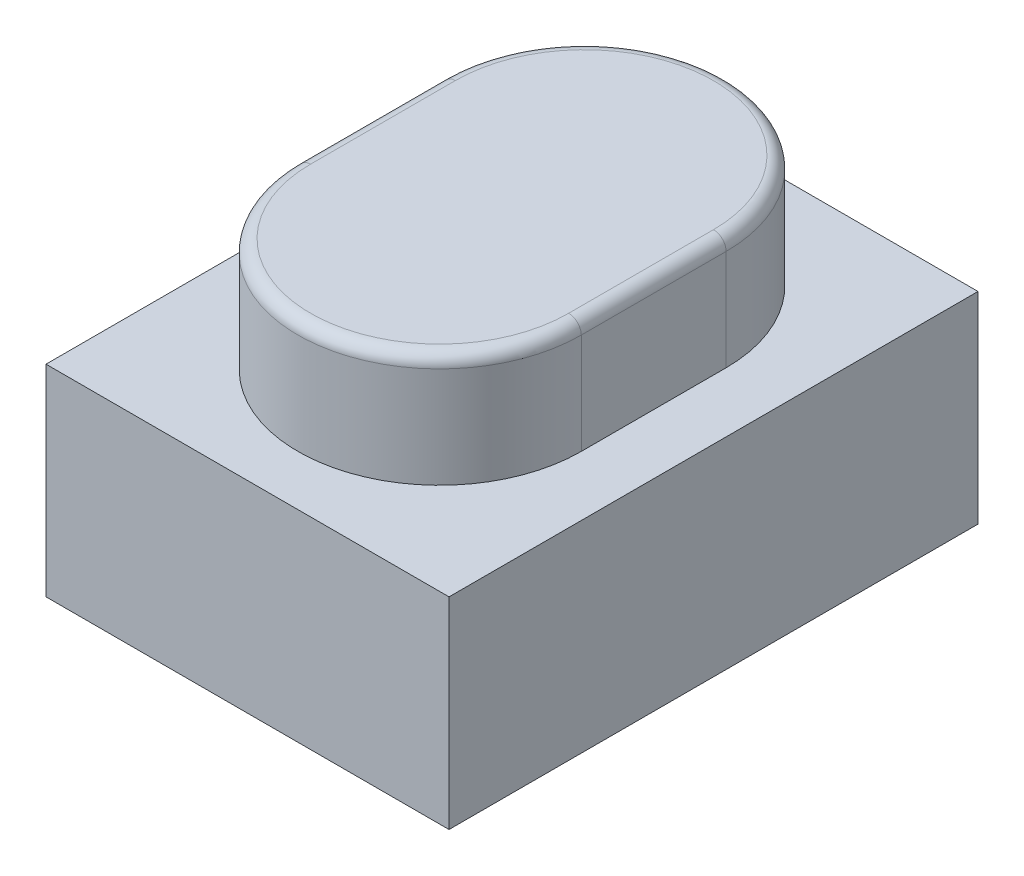
ISO-10303-21;
HEADER;
FILE_DESCRIPTION(('STEP AP214'),'2;1');
FILE_NAME('part.step','',(''),(''),'','','');
FILE_SCHEMA(('AUTOMOTIVE_DESIGN { 1 0 10303 214 1 1 1 1 }'));
ENDSEC;
DATA;
#1=APPLICATION_CONTEXT('core data for automotive mechanical design processes');
#2=APPLICATION_PROTOCOL_DEFINITION('international standard','automotive_design',2000,#1);
#3=PRODUCT_CONTEXT('',#1,'mechanical');
#4=PRODUCT('Part','Part','',(#3));
#5=PRODUCT_RELATED_PRODUCT_CATEGORY('part','',(#4));
#6=PRODUCT_DEFINITION_FORMATION('','',#4);
#7=PRODUCT_DEFINITION_CONTEXT('part definition',#1,'design');
#8=PRODUCT_DEFINITION('design','',#6,#7);
#9=PRODUCT_DEFINITION_SHAPE('','',#8);
#10=(LENGTH_UNIT() NAMED_UNIT(*) SI_UNIT(.MILLI.,.METRE.));
#11=(NAMED_UNIT(*) PLANE_ANGLE_UNIT() SI_UNIT($,.RADIAN.));
#12=(NAMED_UNIT(*) SI_UNIT($,.STERADIAN.) SOLID_ANGLE_UNIT());
#13=UNCERTAINTY_MEASURE_WITH_UNIT(LENGTH_MEASURE(1.E-05),#10,'distance_accuracy_value','');
#14=(GEOMETRIC_REPRESENTATION_CONTEXT(3) GLOBAL_UNCERTAINTY_ASSIGNED_CONTEXT((#13)) GLOBAL_UNIT_ASSIGNED_CONTEXT((#10,
#11,#12)) REPRESENTATION_CONTEXT('',''));
#15=CARTESIAN_POINT('',(0.,0.,0.));
#16=DIRECTION('',(0.,0.,1.));
#17=DIRECTION('',(1.,0.,0.));
#18=AXIS2_PLACEMENT_3D('',#15,#16,#17);
#19=CARTESIAN_POINT('',(1.6,1.6,-2.1));
#20=DIRECTION('',(-1.,0.,0.));
#21=DIRECTION('',(0.,0.,1.));
#22=AXIS2_PLACEMENT_3D('',#19,#20,#21);
#23=PLANE('',#22);
#24=DIRECTION('',(0.,0.,-1.));
#25=VECTOR('',#24,1.);
#26=CARTESIAN_POINT('',(1.6,0.,-2.1));
#27=LINE('',#26,#25);
#28=CARTESIAN_POINT('',(1.6,0.,2.1));
#29=VERTEX_POINT('',#28);
#30=CARTESIAN_POINT('',(1.6,0.,-2.1));
#31=VERTEX_POINT('',#30);
#32=EDGE_CURVE('E148',#29,#31,#27,.T.);
#33=ORIENTED_EDGE('',*,*,#32,.T.);
#34=DIRECTION('',(0.,-1.,0.));
#35=VECTOR('',#34,1.);
#36=CARTESIAN_POINT('',(1.6,1.6,-2.1));
#37=LINE('',#36,#35);
#38=CARTESIAN_POINT('',(1.6,1.6,-2.1));
#39=VERTEX_POINT('',#38);
#40=EDGE_CURVE('E175',#39,#31,#37,.T.);
#41=ORIENTED_EDGE('',*,*,#40,.F.);
#42=DIRECTION('',(0.,0.,-1.));
#43=VECTOR('',#42,1.);
#44=CARTESIAN_POINT('',(1.6,1.6,-2.1));
#45=LINE('',#44,#43);
#46=CARTESIAN_POINT('',(1.6,1.6,2.1));
#47=VERTEX_POINT('',#46);
#48=EDGE_CURVE('E149',#47,#39,#45,.T.);
#49=ORIENTED_EDGE('',*,*,#48,.F.);
#50=DIRECTION('',(0.,-1.,0.));
#51=VECTOR('',#50,1.);
#52=CARTESIAN_POINT('',(1.6,1.6,2.1));
#53=LINE('',#52,#51);
#54=EDGE_CURVE('E159',#47,#29,#53,.T.);
#55=ORIENTED_EDGE('',*,*,#54,.T.);
#56=EDGE_LOOP('',(#33,#41,#49,#55));
#57=FACE_BOUND('',#56,.T.);
#58=ADVANCED_FACE('F43',(#57),#23,.F.);
#59=CARTESIAN_POINT('',(-1.6,1.6,-2.1));
#60=DIRECTION('',(0.,0.,1.));
#61=DIRECTION('',(1.,0.,0.));
#62=AXIS2_PLACEMENT_3D('',#59,#60,#61);
#63=PLANE('',#62);
#64=DIRECTION('',(-1.,0.,0.));
#65=VECTOR('',#64,1.);
#66=CARTESIAN_POINT('',(-1.6,0.,-2.1));
#67=LINE('',#66,#65);
#68=CARTESIAN_POINT('',(-1.6,0.,-2.1));
#69=VERTEX_POINT('',#68);
#70=EDGE_CURVE('E162',#31,#69,#67,.T.);
#71=ORIENTED_EDGE('',*,*,#70,.T.);
#72=DIRECTION('',(0.,-1.,0.));
#73=VECTOR('',#72,1.);
#74=CARTESIAN_POINT('',(-1.6,1.6,-2.1));
#75=LINE('',#74,#73);
#76=CARTESIAN_POINT('',(-1.6,1.6,-2.1));
#77=VERTEX_POINT('',#76);
#78=EDGE_CURVE('E172',#77,#69,#75,.T.);
#79=ORIENTED_EDGE('',*,*,#78,.F.);
#80=DIRECTION('',(-1.,0.,0.));
#81=VECTOR('',#80,1.);
#82=CARTESIAN_POINT('',(-1.6,1.6,-2.1));
#83=LINE('',#82,#81);
#84=EDGE_CURVE('E152',#39,#77,#83,.T.);
#85=ORIENTED_EDGE('',*,*,#84,.F.);
#86=ORIENTED_EDGE('',*,*,#40,.T.);
#87=EDGE_LOOP('',(#71,#79,#85,#86));
#88=FACE_BOUND('',#87,.T.);
#89=ADVANCED_FACE('F230',(#88),#63,.F.);
#90=CARTESIAN_POINT('',(-1.6,1.6,-2.1));
#91=DIRECTION('',(1.,0.,0.));
#92=DIRECTION('',(0.,0.,-1.));
#93=AXIS2_PLACEMENT_3D('',#90,#91,#92);
#94=PLANE('',#93);
#95=DIRECTION('',(0.,0.,1.));
#96=VECTOR('',#95,1.);
#97=CARTESIAN_POINT('',(-1.6,0.,-2.1));
#98=LINE('',#97,#96);
#99=CARTESIAN_POINT('',(-1.6,0.,2.1));
#100=VERTEX_POINT('',#99);
#101=EDGE_CURVE('E164',#69,#100,#98,.T.);
#102=ORIENTED_EDGE('',*,*,#101,.T.);
#103=DIRECTION('',(0.,-1.,0.));
#104=VECTOR('',#103,1.);
#105=CARTESIAN_POINT('',(-1.6,1.6,2.1));
#106=LINE('',#105,#104);
#107=CARTESIAN_POINT('',(-1.6,1.6,2.1));
#108=VERTEX_POINT('',#107);
#109=EDGE_CURVE('E169',#108,#100,#106,.T.);
#110=ORIENTED_EDGE('',*,*,#109,.F.);
#111=DIRECTION('',(0.,0.,1.));
#112=VECTOR('',#111,1.);
#113=CARTESIAN_POINT('',(-1.6,1.6,-2.1));
#114=LINE('',#113,#112);
#115=EDGE_CURVE('E155',#77,#108,#114,.T.);
#116=ORIENTED_EDGE('',*,*,#115,.F.);
#117=ORIENTED_EDGE('',*,*,#78,.T.);
#118=EDGE_LOOP('',(#102,#110,#116,#117));
#119=FACE_BOUND('',#118,.T.);
#120=ADVANCED_FACE('F236',(#119),#94,.F.);
#121=CARTESIAN_POINT('',(-1.6,1.6,2.1));
#122=DIRECTION('',(0.,0.,-1.));
#123=DIRECTION('',(-1.,0.,0.));
#124=AXIS2_PLACEMENT_3D('',#121,#122,#123);
#125=PLANE('',#124);
#126=DIRECTION('',(1.,0.,0.));
#127=VECTOR('',#126,1.);
#128=CARTESIAN_POINT('',(-1.6,0.,2.1));
#129=LINE('',#128,#127);
#130=EDGE_CURVE('E153',#100,#29,#129,.T.);
#131=ORIENTED_EDGE('',*,*,#130,.T.);
#132=ORIENTED_EDGE('',*,*,#54,.F.);
#133=DIRECTION('',(1.,0.,0.));
#134=VECTOR('',#133,1.);
#135=CARTESIAN_POINT('',(-1.6,1.6,2.1));
#136=LINE('',#135,#134);
#137=EDGE_CURVE('E157',#108,#47,#136,.T.);
#138=ORIENTED_EDGE('',*,*,#137,.F.);
#139=ORIENTED_EDGE('',*,*,#109,.T.);
#140=EDGE_LOOP('',(#131,#132,#138,#139));
#141=FACE_BOUND('',#140,.T.);
#142=ADVANCED_FACE('F326',(#141),#125,.F.);
#143=CARTESIAN_POINT('',(0.,1.6,0.));
#144=DIRECTION('',(0.,1.,0.));
#145=DIRECTION('',(0.,0.,1.));
#146=AXIS2_PLACEMENT_3D('',#143,#144,#145);
#147=PLANE('',#146);
#148=CARTESIAN_POINT('',(0.,1.6,-0.575));
#149=DIRECTION('',(0.,1.,0.));
#150=DIRECTION('',(0.,0.,1.));
#151=AXIS2_PLACEMENT_3D('',#148,#149,#150);
#152=CIRCLE('',#151,1.125);
#153=CARTESIAN_POINT('',(1.125,1.6,-0.575000000000001));
#154=VERTEX_POINT('',#153);
#155=CARTESIAN_POINT('',(-1.125,1.6,-0.575));
#156=VERTEX_POINT('',#155);
#157=EDGE_CURVE('E139',#154,#156,#152,.T.);
#158=ORIENTED_EDGE('',*,*,#157,.F.);
#159=DIRECTION('',(0.,0.,-1.));
#160=VECTOR('',#159,1.);
#161=CARTESIAN_POINT('',(1.125,1.6,-0.575000000000001));
#162=LINE('',#161,#160);
#163=CARTESIAN_POINT('',(1.125,1.6,0.575));
#164=VERTEX_POINT('',#163);
#165=EDGE_CURVE('E136',#164,#154,#162,.T.);
#166=ORIENTED_EDGE('',*,*,#165,.F.);
#167=CARTESIAN_POINT('',(0.,1.6,0.575));
#168=DIRECTION('',(0.,1.,0.));
#169=DIRECTION('',(0.,0.,1.));
#170=AXIS2_PLACEMENT_3D('',#167,#168,#169);
#171=CIRCLE('',#170,1.125);
#172=CARTESIAN_POINT('',(-1.125,1.6,0.575));
#173=VERTEX_POINT('',#172);
#174=EDGE_CURVE('E122',#173,#164,#171,.T.);
#175=ORIENTED_EDGE('',*,*,#174,.F.);
#176=DIRECTION('',(0.,0.,1.));
#177=VECTOR('',#176,1.);
#178=CARTESIAN_POINT('',(-1.125,1.6,-0.575));
#179=LINE('',#178,#177);
#180=EDGE_CURVE('E133',#156,#173,#179,.T.);
#181=ORIENTED_EDGE('',*,*,#180,.F.);
#182=EDGE_LOOP('',(#158,#166,#175,#181));
#183=FACE_BOUND('',#182,.T.);
#184=ORIENTED_EDGE('',*,*,#48,.T.);
#185=ORIENTED_EDGE('',*,*,#84,.T.);
#186=ORIENTED_EDGE('',*,*,#115,.T.);
#187=ORIENTED_EDGE('',*,*,#137,.T.);
#188=EDGE_LOOP('',(#184,#185,#186,#187));
#189=FACE_BOUND('',#188,.T.);
#190=ADVANCED_FACE('F131',(#183,#189),#147,.T.);
#191=CARTESIAN_POINT('',(0.,0.,0.));
#192=DIRECTION('',(0.,1.,0.));
#193=DIRECTION('',(0.,0.,1.));
#194=AXIS2_PLACEMENT_3D('',#191,#192,#193);
#195=PLANE('',#194);
#196=ORIENTED_EDGE('',*,*,#32,.F.);
#197=ORIENTED_EDGE('',*,*,#130,.F.);
#198=ORIENTED_EDGE('',*,*,#101,.F.);
#199=ORIENTED_EDGE('',*,*,#70,.F.);
#200=EDGE_LOOP('',(#196,#197,#198,#199));
#201=FACE_BOUND('',#200,.T.);
#202=ADVANCED_FACE('F314',(#201),#195,.F.);
#203=CARTESIAN_POINT('',(0.,2.5,-0.575));
#204=DIRECTION('',(0.,-1.,0.));
#205=DIRECTION('',(0.,0.,-1.));
#206=AXIS2_PLACEMENT_3D('',#203,#204,#205);
#207=CYLINDRICAL_SURFACE('',#206,1.125);
#208=DIRECTION('',(0.,-1.,0.));
#209=VECTOR('',#208,1.);
#210=CARTESIAN_POINT('',(-1.125,2.5,-0.575));
#211=LINE('',#210,#209);
#212=CARTESIAN_POINT('',(-1.125,2.4,-0.575));
#213=VERTEX_POINT('',#212);
#214=EDGE_CURVE('E124',#213,#156,#211,.T.);
#215=ORIENTED_EDGE('',*,*,#214,.F.);
#216=CARTESIAN_POINT('',(0.,2.4,-0.575));
#217=DIRECTION('',(0.,1.,0.));
#218=DIRECTION('',(0.,0.,1.));
#219=AXIS2_PLACEMENT_3D('',#216,#217,#218);
#220=CIRCLE('',#219,1.125);
#221=CARTESIAN_POINT('',(1.125,2.4,-0.575000000000001));
#222=VERTEX_POINT('',#221);
#223=EDGE_CURVE('E11',#213,#222,#220,.F.);
#224=ORIENTED_EDGE('',*,*,#223,.T.);
#225=DIRECTION('',(0.,-1.,0.));
#226=VECTOR('',#225,1.);
#227=CARTESIAN_POINT('',(1.125,2.5,-0.575000000000001));
#228=LINE('',#227,#226);
#229=EDGE_CURVE('E144',#222,#154,#228,.T.);
#230=ORIENTED_EDGE('',*,*,#229,.T.);
#231=ORIENTED_EDGE('',*,*,#157,.T.);
#232=EDGE_LOOP('',(#215,#224,#230,#231));
#233=FACE_BOUND('',#232,.T.);
#234=ADVANCED_FACE('F213',(#233),#207,.T.);
#235=CARTESIAN_POINT('',(-1.125,2.5,-0.575));
#236=DIRECTION('',(1.,0.,0.));
#237=DIRECTION('',(0.,0.,-1.));
#238=AXIS2_PLACEMENT_3D('',#235,#236,#237);
#239=PLANE('',#238);
#240=DIRECTION('',(0.,-1.,0.));
#241=VECTOR('',#240,1.);
#242=CARTESIAN_POINT('',(-1.125,2.5,0.575));
#243=LINE('',#242,#241);
#244=CARTESIAN_POINT('',(-1.125,2.4,0.575));
#245=VERTEX_POINT('',#244);
#246=EDGE_CURVE('E119',#245,#173,#243,.T.);
#247=ORIENTED_EDGE('',*,*,#246,.F.);
#248=DIRECTION('',(0.,0.,1.));
#249=VECTOR('',#248,1.);
#250=CARTESIAN_POINT('',(-1.125,2.4,-0.575));
#251=LINE('',#250,#249);
#252=EDGE_CURVE('E52',#245,#213,#251,.F.);
#253=ORIENTED_EDGE('',*,*,#252,.T.);
#254=ORIENTED_EDGE('',*,*,#214,.T.);
#255=ORIENTED_EDGE('',*,*,#180,.T.);
#256=EDGE_LOOP('',(#247,#253,#254,#255));
#257=FACE_BOUND('',#256,.T.);
#258=ADVANCED_FACE('F138',(#257),#239,.F.);
#259=CARTESIAN_POINT('',(0.,2.5,0.575));
#260=DIRECTION('',(0.,-1.,0.));
#261=DIRECTION('',(0.,0.,-1.));
#262=AXIS2_PLACEMENT_3D('',#259,#260,#261);
#263=CYLINDRICAL_SURFACE('',#262,1.125);
#264=DIRECTION('',(0.,-1.,0.));
#265=VECTOR('',#264,1.);
#266=CARTESIAN_POINT('',(1.125,2.5,0.575));
#267=LINE('',#266,#265);
#268=CARTESIAN_POINT('',(1.125,2.4,0.575));
#269=VERTEX_POINT('',#268);
#270=EDGE_CURVE('E125',#269,#164,#267,.T.);
#271=ORIENTED_EDGE('',*,*,#270,.F.);
#272=CARTESIAN_POINT('',(0.,2.4,0.575));
#273=DIRECTION('',(0.,1.,0.));
#274=DIRECTION('',(0.,0.,1.));
#275=AXIS2_PLACEMENT_3D('',#272,#273,#274);
#276=CIRCLE('',#275,1.125);
#277=EDGE_CURVE('E67',#269,#245,#276,.F.);
#278=ORIENTED_EDGE('',*,*,#277,.T.);
#279=ORIENTED_EDGE('',*,*,#246,.T.);
#280=ORIENTED_EDGE('',*,*,#174,.T.);
#281=EDGE_LOOP('',(#271,#278,#279,#280));
#282=FACE_BOUND('',#281,.T.);
#283=ADVANCED_FACE('F121',(#282),#263,.T.);
#284=CARTESIAN_POINT('',(1.125,2.5,-0.575000000000001));
#285=DIRECTION('',(-1.,0.,0.));
#286=DIRECTION('',(0.,0.,1.));
#287=AXIS2_PLACEMENT_3D('',#284,#285,#286);
#288=PLANE('',#287);
#289=ORIENTED_EDGE('',*,*,#229,.F.);
#290=DIRECTION('',(0.,0.,-1.));
#291=VECTOR('',#290,1.);
#292=CARTESIAN_POINT('',(1.125,2.4,0.575));
#293=LINE('',#292,#291);
#294=EDGE_CURVE('E187',#222,#269,#293,.F.);
#295=ORIENTED_EDGE('',*,*,#294,.T.);
#296=ORIENTED_EDGE('',*,*,#270,.T.);
#297=ORIENTED_EDGE('',*,*,#165,.T.);
#298=EDGE_LOOP('',(#289,#295,#296,#297));
#299=FACE_BOUND('',#298,.T.);
#300=ADVANCED_FACE('F216',(#299),#288,.F.);
#301=CARTESIAN_POINT('',(0.,2.5,-0.575));
#302=DIRECTION('',(0.,1.,0.));
#303=DIRECTION('',(0.,0.,1.));
#304=AXIS2_PLACEMENT_3D('',#301,#302,#303);
#305=PLANE('',#304);
#306=CARTESIAN_POINT('',(0.,2.5,0.575));
#307=DIRECTION('',(0.,1.,0.));
#308=DIRECTION('',(0.,0.,1.));
#309=AXIS2_PLACEMENT_3D('',#306,#307,#308);
#310=CIRCLE('',#309,1.025);
#311=CARTESIAN_POINT('',(-1.025,2.5,0.575));
#312=VERTEX_POINT('',#311);
#313=CARTESIAN_POINT('',(1.025,2.5,0.575));
#314=VERTEX_POINT('',#313);
#315=EDGE_CURVE('E182',#312,#314,#310,.T.);
#316=ORIENTED_EDGE('',*,*,#315,.T.);
#317=DIRECTION('',(0.,0.,-1.));
#318=VECTOR('',#317,1.);
#319=CARTESIAN_POINT('',(1.025,2.5,-0.575000000000001));
#320=LINE('',#319,#318);
#321=CARTESIAN_POINT('',(1.025,2.5,-0.575000000000001));
#322=VERTEX_POINT('',#321);
#323=EDGE_CURVE('E184',#314,#322,#320,.T.);
#324=ORIENTED_EDGE('',*,*,#323,.T.);
#325=CARTESIAN_POINT('',(0.,2.5,-0.575));
#326=DIRECTION('',(0.,1.,0.));
#327=DIRECTION('',(0.,0.,1.));
#328=AXIS2_PLACEMENT_3D('',#325,#326,#327);
#329=CIRCLE('',#328,1.025);
#330=CARTESIAN_POINT('',(-1.025,2.5,-0.575));
#331=VERTEX_POINT('',#330);
#332=EDGE_CURVE('E178',#322,#331,#329,.T.);
#333=ORIENTED_EDGE('',*,*,#332,.T.);
#334=DIRECTION('',(0.,0.,1.));
#335=VECTOR('',#334,1.);
#336=CARTESIAN_POINT('',(-1.025,2.5,0.575));
#337=LINE('',#336,#335);
#338=EDGE_CURVE('E180',#331,#312,#337,.T.);
#339=ORIENTED_EDGE('',*,*,#338,.T.);
#340=EDGE_LOOP('',(#316,#324,#333,#339));
#341=FACE_BOUND('',#340,.T.);
#342=ADVANCED_FACE('F221',(#341),#305,.T.);
#343=CARTESIAN_POINT('',(-1.025,2.4,-0.575));
#344=DIRECTION('',(0.,0.,-1.));
#345=DIRECTION('',(-1.,0.,0.));
#346=AXIS2_PLACEMENT_3D('',#343,#344,#345);
#347=CYLINDRICAL_SURFACE('',#346,0.1);
#348=CARTESIAN_POINT('',(-1.025,2.4,-0.575));
#349=DIRECTION('',(0.,0.,-1.));
#350=DIRECTION('',(-1.,0.,0.));
#351=AXIS2_PLACEMENT_3D('',#348,#349,#350);
#352=CIRCLE('',#351,0.1);
#353=EDGE_CURVE('E195',#213,#331,#352,.T.);
#354=ORIENTED_EDGE('',*,*,#353,.F.);
#355=ORIENTED_EDGE('',*,*,#252,.F.);
#356=CARTESIAN_POINT('',(-1.025,2.4,0.575));
#357=DIRECTION('',(0.,0.,1.));
#358=DIRECTION('',(1.,0.,0.));
#359=AXIS2_PLACEMENT_3D('',#356,#357,#358);
#360=CIRCLE('',#359,0.1);
#361=EDGE_CURVE('E47',#312,#245,#360,.T.);
#362=ORIENTED_EDGE('',*,*,#361,.F.);
#363=ORIENTED_EDGE('',*,*,#338,.F.);
#364=EDGE_LOOP('',(#354,#355,#362,#363));
#365=FACE_BOUND('',#364,.T.);
#366=ADVANCED_FACE('F45',(#365),#347,.T.);
#367=CARTESIAN_POINT('',(0.,2.4,0.575));
#368=DIRECTION('',(0.,1.,0.));
#369=DIRECTION('',(0.,0.,1.));
#370=AXIS2_PLACEMENT_3D('',#367,#368,#369);
#371=TOROIDAL_SURFACE('',#370,1.025,0.1);
#372=ORIENTED_EDGE('',*,*,#361,.T.);
#373=ORIENTED_EDGE('',*,*,#277,.F.);
#374=CARTESIAN_POINT('',(1.025,2.4,0.575));
#375=DIRECTION('',(0.,0.,-1.));
#376=DIRECTION('',(-1.,0.,0.));
#377=AXIS2_PLACEMENT_3D('',#374,#375,#376);
#378=CIRCLE('',#377,0.1);
#379=EDGE_CURVE('E194',#314,#269,#378,.T.);
#380=ORIENTED_EDGE('',*,*,#379,.F.);
#381=ORIENTED_EDGE('',*,*,#315,.F.);
#382=EDGE_LOOP('',(#372,#373,#380,#381));
#383=FACE_BOUND('',#382,.T.);
#384=ADVANCED_FACE('F205',(#383),#371,.T.);
#385=CARTESIAN_POINT('',(0.,2.4,-0.575));
#386=DIRECTION('',(0.,1.,0.));
#387=DIRECTION('',(0.,0.,1.));
#388=AXIS2_PLACEMENT_3D('',#385,#386,#387);
#389=TOROIDAL_SURFACE('',#388,1.025,0.1);
#390=ORIENTED_EDGE('',*,*,#353,.T.);
#391=ORIENTED_EDGE('',*,*,#332,.F.);
#392=CARTESIAN_POINT('',(1.025,2.4,-0.575000000000001));
#393=DIRECTION('',(0.,0.,1.));
#394=DIRECTION('',(1.,0.,0.));
#395=AXIS2_PLACEMENT_3D('',#392,#393,#394);
#396=CIRCLE('',#395,0.1);
#397=EDGE_CURVE('E192',#222,#322,#396,.T.);
#398=ORIENTED_EDGE('',*,*,#397,.F.);
#399=ORIENTED_EDGE('',*,*,#223,.F.);
#400=EDGE_LOOP('',(#390,#391,#398,#399));
#401=FACE_BOUND('',#400,.T.);
#402=ADVANCED_FACE('F210',(#401),#389,.T.);
#403=CARTESIAN_POINT('',(1.025,2.4,-0.575));
#404=DIRECTION('',(0.,0.,1.));
#405=DIRECTION('',(1.,0.,0.));
#406=AXIS2_PLACEMENT_3D('',#403,#404,#405);
#407=CYLINDRICAL_SURFACE('',#406,0.1);
#408=ORIENTED_EDGE('',*,*,#379,.T.);
#409=ORIENTED_EDGE('',*,*,#294,.F.);
#410=ORIENTED_EDGE('',*,*,#397,.T.);
#411=ORIENTED_EDGE('',*,*,#323,.F.);
#412=EDGE_LOOP('',(#408,#409,#410,#411));
#413=FACE_BOUND('',#412,.T.);
#414=ADVANCED_FACE('F218',(#413),#407,.T.);
#415=CLOSED_SHELL('',(#58,#89,#120,#142,#190,#202,#234,#258,#283,#300,#342,#366,#384,#402,#414));
#416=MANIFOLD_SOLID_BREP('B2',#415);
#417=ADVANCED_BREP_SHAPE_REPRESENTATION('',(#18,#416),#14);
#418=SHAPE_DEFINITION_REPRESENTATION(#9,#417);
ENDSEC;
END-ISO-10303-21;
